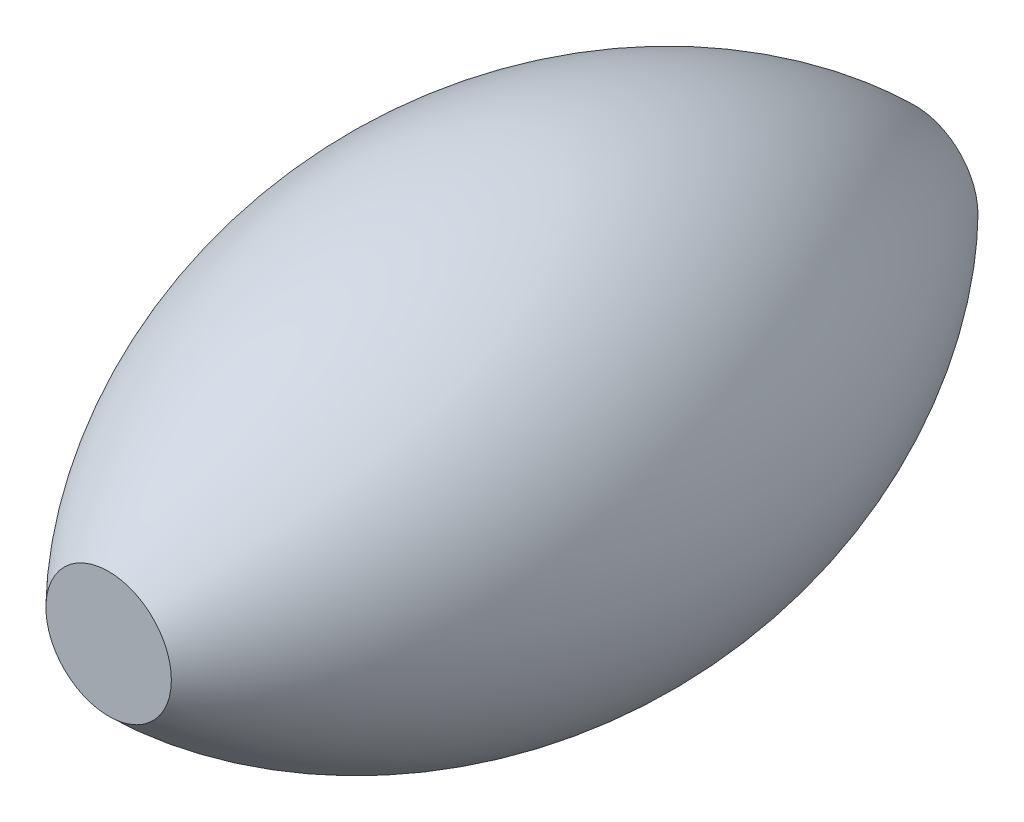
ISO-10303-21;
HEADER;
FILE_DESCRIPTION(('STEP AP214'),'2;1');
FILE_NAME('part.step','',(''),(''),'','','');
FILE_SCHEMA(('AUTOMOTIVE_DESIGN { 1 0 10303 214 1 1 1 1 }'));
ENDSEC;
DATA;
#1=APPLICATION_CONTEXT('core data for automotive mechanical design processes');
#2=APPLICATION_PROTOCOL_DEFINITION('international standard','automotive_design',2000,#1);
#3=PRODUCT_CONTEXT('',#1,'mechanical');
#4=PRODUCT('Part','Part','',(#3));
#5=PRODUCT_RELATED_PRODUCT_CATEGORY('part','',(#4));
#6=PRODUCT_DEFINITION_FORMATION('','',#4);
#7=PRODUCT_DEFINITION_CONTEXT('part definition',#1,'design');
#8=PRODUCT_DEFINITION('design','',#6,#7);
#9=PRODUCT_DEFINITION_SHAPE('','',#8);
#10=(LENGTH_UNIT() NAMED_UNIT(*) SI_UNIT(.MILLI.,.METRE.));
#11=(NAMED_UNIT(*) PLANE_ANGLE_UNIT() SI_UNIT($,.RADIAN.));
#12=(NAMED_UNIT(*) SI_UNIT($,.STERADIAN.) SOLID_ANGLE_UNIT());
#13=UNCERTAINTY_MEASURE_WITH_UNIT(LENGTH_MEASURE(1.E-05),#10,'distance_accuracy_value','');
#14=(GEOMETRIC_REPRESENTATION_CONTEXT(3) GLOBAL_UNCERTAINTY_ASSIGNED_CONTEXT((#13)) GLOBAL_UNIT_ASSIGNED_CONTEXT((#10,
#11,#12)) REPRESENTATION_CONTEXT('',''));
#15=CARTESIAN_POINT('',(0.,0.,0.));
#16=DIRECTION('',(0.,0.,1.));
#17=DIRECTION('',(1.,0.,0.));
#18=AXIS2_PLACEMENT_3D('',#15,#16,#17);
#19=CARTESIAN_POINT('',(0.,0.,0.));
#20=DIRECTION('',(0.,0.,1.));
#21=DIRECTION('',(1.,0.,0.));
#22=AXIS2_PLACEMENT_3D('',#19,#20,#21);
#23=DEGENERATE_TOROIDAL_SURFACE('',#22,97.0679347826087,160.567934782609,.F.);
#24=CARTESIAN_POINT('',(0.,0.,112.5));
#25=DIRECTION('',(0.,0.,1.));
#26=DIRECTION('',(1.,0.,0.));
#27=AXIS2_PLACEMENT_3D('',#24,#25,#26);
#28=CIRCLE('',#27,17.5);
#29=CARTESIAN_POINT('',(17.5,0.,112.5));
#30=VERTEX_POINT('',#29);
#31=EDGE_CURVE('E48',#30,#30,#28,.T.);
#32=ORIENTED_EDGE('',*,*,#31,.F.);
#33=EDGE_LOOP('',(#32));
#34=FACE_BOUND('',#33,.T.);
#35=CARTESIAN_POINT('',(0.,0.,-112.5));
#36=DIRECTION('',(0.,0.,1.));
#37=DIRECTION('',(1.,0.,0.));
#38=AXIS2_PLACEMENT_3D('',#35,#36,#37);
#39=CIRCLE('',#38,17.5);
#40=CARTESIAN_POINT('',(17.5,0.,-112.5));
#41=VERTEX_POINT('',#40);
#42=EDGE_CURVE('E12',#41,#41,#39,.T.);
#43=ORIENTED_EDGE('',*,*,#42,.T.);
#44=EDGE_LOOP('',(#43));
#45=FACE_BOUND('',#44,.T.);
#46=ADVANCED_FACE('F42',(#34,#45),#23,.F.);
#47=CARTESIAN_POINT('',(0.,0.,-112.5));
#48=DIRECTION('',(0.,0.,1.));
#49=DIRECTION('',(1.,0.,0.));
#50=AXIS2_PLACEMENT_3D('',#47,#48,#49);
#51=PLANE('',#50);
#52=ORIENTED_EDGE('',*,*,#42,.F.);
#53=EDGE_LOOP('',(#52));
#54=FACE_BOUND('',#53,.T.);
#55=ADVANCED_FACE('F57',(#54),#51,.F.);
#56=CARTESIAN_POINT('',(0.,17.5,112.5));
#57=DIRECTION('',(0.,0.,-1.));
#58=DIRECTION('',(-1.,0.,0.));
#59=AXIS2_PLACEMENT_3D('',#56,#57,#58);
#60=PLANE('',#59);
#61=ORIENTED_EDGE('',*,*,#31,.T.);
#62=EDGE_LOOP('',(#61));
#63=FACE_BOUND('',#62,.T.);
#64=ADVANCED_FACE('F54',(#63),#60,.F.);
#65=CLOSED_SHELL('',(#46,#55,#64));
#66=MANIFOLD_SOLID_BREP('B2',#65);
#67=ADVANCED_BREP_SHAPE_REPRESENTATION('',(#18,#66),#14);
#68=SHAPE_DEFINITION_REPRESENTATION(#9,#67);
ENDSEC;
END-ISO-10303-21;
